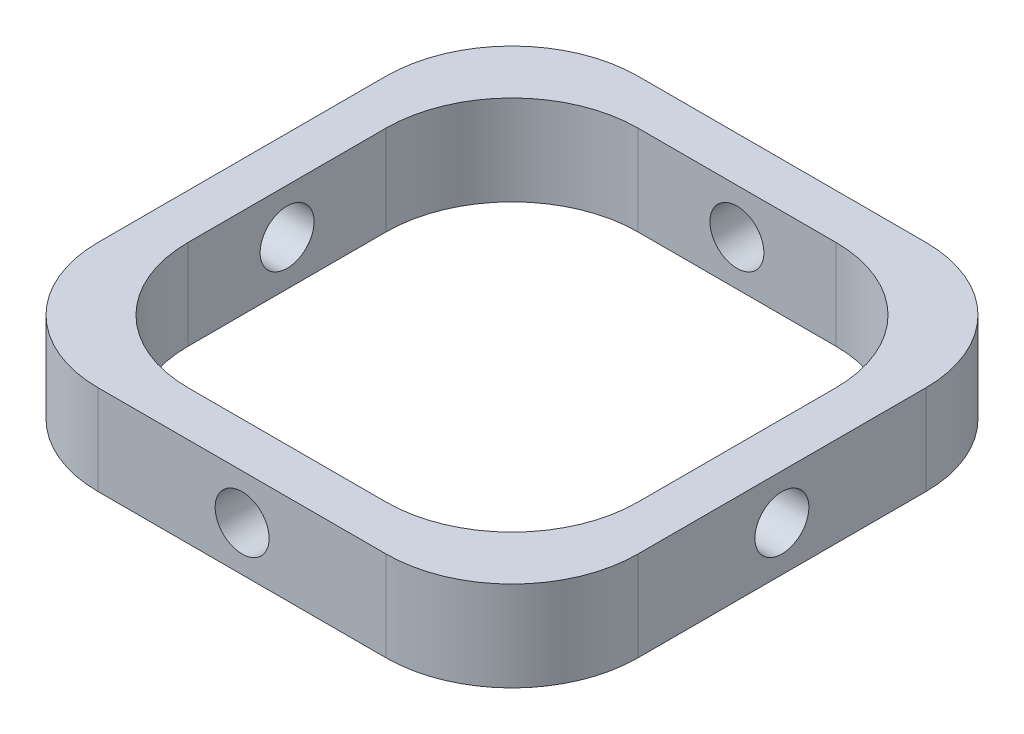
ISO-10303-21;
HEADER;
FILE_DESCRIPTION(('STEP AP214'),'2;1');
FILE_NAME('part.step','',(''),(''),'','','');
FILE_SCHEMA(('AUTOMOTIVE_DESIGN { 1 0 10303 214 1 1 1 1 }'));
ENDSEC;
DATA;
#1=APPLICATION_CONTEXT('core data for automotive mechanical design processes');
#2=APPLICATION_PROTOCOL_DEFINITION('international standard','automotive_design',2000,#1);
#3=PRODUCT_CONTEXT('',#1,'mechanical');
#4=PRODUCT('Part','Part','',(#3));
#5=PRODUCT_RELATED_PRODUCT_CATEGORY('part','',(#4));
#6=PRODUCT_DEFINITION_FORMATION('','',#4);
#7=PRODUCT_DEFINITION_CONTEXT('part definition',#1,'design');
#8=PRODUCT_DEFINITION('design','',#6,#7);
#9=PRODUCT_DEFINITION_SHAPE('','',#8);
#10=(LENGTH_UNIT() NAMED_UNIT(*) SI_UNIT(.MILLI.,.METRE.));
#11=(NAMED_UNIT(*) PLANE_ANGLE_UNIT() SI_UNIT($,.RADIAN.));
#12=(NAMED_UNIT(*) SI_UNIT($,.STERADIAN.) SOLID_ANGLE_UNIT());
#13=UNCERTAINTY_MEASURE_WITH_UNIT(LENGTH_MEASURE(1.E-05),#10,'distance_accuracy_value','');
#14=(GEOMETRIC_REPRESENTATION_CONTEXT(3) GLOBAL_UNCERTAINTY_ASSIGNED_CONTEXT((#13)) GLOBAL_UNIT_ASSIGNED_CONTEXT((#10,
#11,#12)) REPRESENTATION_CONTEXT('',''));
#15=CARTESIAN_POINT('',(0.,0.,0.));
#16=DIRECTION('',(0.,0.,1.));
#17=DIRECTION('',(1.,0.,0.));
#18=AXIS2_PLACEMENT_3D('',#15,#16,#17);
#19=CARTESIAN_POINT('',(0.,5.,0.));
#20=DIRECTION('',(0.,-1.,0.));
#21=DIRECTION('',(0.,0.,-1.));
#22=AXIS2_PLACEMENT_3D('',#19,#20,#21);
#23=PLANE('',#22);
#24=DIRECTION('',(0.,0.,1.));
#25=VECTOR('',#24,1.);
#26=CARTESIAN_POINT('',(-15.,5.,15.));
#27=LINE('',#26,#25);
#28=CARTESIAN_POINT('',(-15.,5.,-8.));
#29=VERTEX_POINT('',#28);
#30=CARTESIAN_POINT('',(-15.,5.,8.));
#31=VERTEX_POINT('',#30);
#32=EDGE_CURVE('E186',#29,#31,#27,.T.);
#33=ORIENTED_EDGE('',*,*,#32,.T.);
#34=CARTESIAN_POINT('',(-8.,5.,8.));
#35=DIRECTION('',(0.,-1.,0.));
#36=DIRECTION('',(0.,0.,-1.));
#37=AXIS2_PLACEMENT_3D('',#34,#35,#36);
#38=CIRCLE('',#37,7.);
#39=CARTESIAN_POINT('',(-8.,5.,15.));
#40=VERTEX_POINT('',#39);
#41=EDGE_CURVE('E228',#31,#40,#38,.F.);
#42=ORIENTED_EDGE('',*,*,#41,.T.);
#43=DIRECTION('',(1.,0.,0.));
#44=VECTOR('',#43,1.);
#45=CARTESIAN_POINT('',(-15.,5.,15.));
#46=LINE('',#45,#44);
#47=CARTESIAN_POINT('',(8.,5.,15.));
#48=VERTEX_POINT('',#47);
#49=EDGE_CURVE('E181',#40,#48,#46,.T.);
#50=ORIENTED_EDGE('',*,*,#49,.T.);
#51=CARTESIAN_POINT('',(8.,5.,8.));
#52=DIRECTION('',(0.,-1.,0.));
#53=DIRECTION('',(0.,0.,-1.));
#54=AXIS2_PLACEMENT_3D('',#51,#52,#53);
#55=CIRCLE('',#54,7.);
#56=CARTESIAN_POINT('',(15.,5.,8.));
#57=VERTEX_POINT('',#56);
#58=EDGE_CURVE('E226',#48,#57,#55,.F.);
#59=ORIENTED_EDGE('',*,*,#58,.T.);
#60=DIRECTION('',(0.,0.,-1.));
#61=VECTOR('',#60,1.);
#62=CARTESIAN_POINT('',(15.,5.,15.));
#63=LINE('',#62,#61);
#64=CARTESIAN_POINT('',(15.,5.,-8.));
#65=VERTEX_POINT('',#64);
#66=EDGE_CURVE('E277',#57,#65,#63,.T.);
#67=ORIENTED_EDGE('',*,*,#66,.T.);
#68=CARTESIAN_POINT('',(8.,5.,-8.));
#69=DIRECTION('',(0.,-1.,0.));
#70=DIRECTION('',(0.,0.,-1.));
#71=AXIS2_PLACEMENT_3D('',#68,#69,#70);
#72=CIRCLE('',#71,7.);
#73=CARTESIAN_POINT('',(8.,5.,-15.));
#74=VERTEX_POINT('',#73);
#75=EDGE_CURVE('E65',#65,#74,#72,.F.);
#76=ORIENTED_EDGE('',*,*,#75,.T.);
#77=DIRECTION('',(-1.,0.,0.));
#78=VECTOR('',#77,1.);
#79=CARTESIAN_POINT('',(-15.,5.,-15.));
#80=LINE('',#79,#78);
#81=CARTESIAN_POINT('',(-8.,5.,-15.));
#82=VERTEX_POINT('',#81);
#83=EDGE_CURVE('E279',#74,#82,#80,.T.);
#84=ORIENTED_EDGE('',*,*,#83,.T.);
#85=CARTESIAN_POINT('',(-8.,5.,-8.));
#86=DIRECTION('',(0.,-1.,0.));
#87=DIRECTION('',(0.,0.,-1.));
#88=AXIS2_PLACEMENT_3D('',#85,#86,#87);
#89=CIRCLE('',#88,7.);
#90=EDGE_CURVE('E223',#82,#29,#89,.F.);
#91=ORIENTED_EDGE('',*,*,#90,.T.);
#92=EDGE_LOOP('',(#33,#42,#50,#59,#67,#76,#84,#91));
#93=FACE_BOUND('',#92,.T.);
#94=DIRECTION('',(0.,0.,1.));
#95=VECTOR('',#94,1.);
#96=CARTESIAN_POINT('',(-12.5,5.,12.5));
#97=LINE('',#96,#95);
#98=CARTESIAN_POINT('',(-12.5,5.,-5.49999999999999));
#99=VERTEX_POINT('',#98);
#100=CARTESIAN_POINT('',(-12.5,5.,5.5));
#101=VERTEX_POINT('',#100);
#102=EDGE_CURVE('E271',#99,#101,#97,.T.);
#103=ORIENTED_EDGE('',*,*,#102,.F.);
#104=CARTESIAN_POINT('',(-5.5,5.,-5.5));
#105=DIRECTION('',(0.,-1.,0.));
#106=DIRECTION('',(0.,0.,-1.));
#107=AXIS2_PLACEMENT_3D('',#104,#105,#106);
#108=CIRCLE('',#107,7.);
#109=CARTESIAN_POINT('',(-5.5,5.,-12.5));
#110=VERTEX_POINT('',#109);
#111=EDGE_CURVE('E11',#99,#110,#108,.T.);
#112=ORIENTED_EDGE('',*,*,#111,.T.);
#113=DIRECTION('',(-1.,0.,0.));
#114=VECTOR('',#113,1.);
#115=CARTESIAN_POINT('',(-12.5,5.,-12.5));
#116=LINE('',#115,#114);
#117=CARTESIAN_POINT('',(5.49999999999999,5.,-12.5));
#118=VERTEX_POINT('',#117);
#119=EDGE_CURVE('E257',#118,#110,#116,.T.);
#120=ORIENTED_EDGE('',*,*,#119,.F.);
#121=CARTESIAN_POINT('',(5.5,5.,-5.5));
#122=DIRECTION('',(0.,-1.,0.));
#123=DIRECTION('',(0.,0.,-1.));
#124=AXIS2_PLACEMENT_3D('',#121,#122,#123);
#125=CIRCLE('',#124,7.);
#126=CARTESIAN_POINT('',(12.5,5.,-5.49999999999999));
#127=VERTEX_POINT('',#126);
#128=EDGE_CURVE('E167',#118,#127,#125,.T.);
#129=ORIENTED_EDGE('',*,*,#128,.T.);
#130=DIRECTION('',(0.,0.,-1.));
#131=VECTOR('',#130,1.);
#132=CARTESIAN_POINT('',(12.5,5.,12.5));
#133=LINE('',#132,#131);
#134=CARTESIAN_POINT('',(12.5,5.,5.5));
#135=VERTEX_POINT('',#134);
#136=EDGE_CURVE('E254',#135,#127,#133,.T.);
#137=ORIENTED_EDGE('',*,*,#136,.F.);
#138=CARTESIAN_POINT('',(5.5,5.,5.5));
#139=DIRECTION('',(0.,-1.,0.));
#140=DIRECTION('',(0.,0.,-1.));
#141=AXIS2_PLACEMENT_3D('',#138,#139,#140);
#142=CIRCLE('',#141,7.);
#143=CARTESIAN_POINT('',(5.5,5.,12.5));
#144=VERTEX_POINT('',#143);
#145=EDGE_CURVE('E245',#135,#144,#142,.T.);
#146=ORIENTED_EDGE('',*,*,#145,.T.);
#147=DIRECTION('',(1.,0.,0.));
#148=VECTOR('',#147,1.);
#149=CARTESIAN_POINT('',(-12.5,5.,12.5));
#150=LINE('',#149,#148);
#151=CARTESIAN_POINT('',(-5.5,5.,12.5));
#152=VERTEX_POINT('',#151);
#153=EDGE_CURVE('E265',#152,#144,#150,.T.);
#154=ORIENTED_EDGE('',*,*,#153,.F.);
#155=CARTESIAN_POINT('',(-5.5,5.,5.5));
#156=DIRECTION('',(0.,-1.,0.));
#157=DIRECTION('',(0.,0.,-1.));
#158=AXIS2_PLACEMENT_3D('',#155,#156,#157);
#159=CIRCLE('',#158,7.);
#160=EDGE_CURVE('E241',#152,#101,#159,.T.);
#161=ORIENTED_EDGE('',*,*,#160,.T.);
#162=EDGE_LOOP('',(#103,#112,#120,#129,#137,#146,#154,#161));
#163=FACE_BOUND('',#162,.T.);
#164=ADVANCED_FACE('F43',(#93,#163),#23,.F.);
#165=CARTESIAN_POINT('',(0.,0.,0.));
#166=DIRECTION('',(0.,-1.,0.));
#167=DIRECTION('',(0.,0.,-1.));
#168=AXIS2_PLACEMENT_3D('',#165,#166,#167);
#169=PLANE('',#168);
#170=DIRECTION('',(1.,0.,0.));
#171=VECTOR('',#170,1.);
#172=CARTESIAN_POINT('',(-15.,0.,15.));
#173=LINE('',#172,#171);
#174=CARTESIAN_POINT('',(-8.,0.,15.));
#175=VERTEX_POINT('',#174);
#176=CARTESIAN_POINT('',(8.,0.,15.));
#177=VERTEX_POINT('',#176);
#178=EDGE_CURVE('E280',#175,#177,#173,.T.);
#179=ORIENTED_EDGE('',*,*,#178,.F.);
#180=CARTESIAN_POINT('',(-8.,0.,8.));
#181=DIRECTION('',(0.,-1.,0.));
#182=DIRECTION('',(0.,0.,-1.));
#183=AXIS2_PLACEMENT_3D('',#180,#181,#182);
#184=CIRCLE('',#183,7.);
#185=CARTESIAN_POINT('',(-15.,0.,8.));
#186=VERTEX_POINT('',#185);
#187=EDGE_CURVE('E216',#175,#186,#184,.T.);
#188=ORIENTED_EDGE('',*,*,#187,.T.);
#189=DIRECTION('',(0.,0.,1.));
#190=VECTOR('',#189,1.);
#191=CARTESIAN_POINT('',(-15.,0.,15.));
#192=LINE('',#191,#190);
#193=CARTESIAN_POINT('',(-15.,0.,-8.));
#194=VERTEX_POINT('',#193);
#195=EDGE_CURVE('E289',#194,#186,#192,.T.);
#196=ORIENTED_EDGE('',*,*,#195,.F.);
#197=CARTESIAN_POINT('',(-8.,0.,-8.));
#198=DIRECTION('',(0.,-1.,0.));
#199=DIRECTION('',(0.,0.,-1.));
#200=AXIS2_PLACEMENT_3D('',#197,#198,#199);
#201=CIRCLE('',#200,7.);
#202=CARTESIAN_POINT('',(-8.,0.,-15.));
#203=VERTEX_POINT('',#202);
#204=EDGE_CURVE('E210',#194,#203,#201,.T.);
#205=ORIENTED_EDGE('',*,*,#204,.T.);
#206=DIRECTION('',(-1.,0.,0.));
#207=VECTOR('',#206,1.);
#208=CARTESIAN_POINT('',(-15.,0.,-15.));
#209=LINE('',#208,#207);
#210=CARTESIAN_POINT('',(8.,0.,-15.));
#211=VERTEX_POINT('',#210);
#212=EDGE_CURVE('E287',#211,#203,#209,.T.);
#213=ORIENTED_EDGE('',*,*,#212,.F.);
#214=CARTESIAN_POINT('',(8.,0.,-8.));
#215=DIRECTION('',(0.,-1.,0.));
#216=DIRECTION('',(0.,0.,-1.));
#217=AXIS2_PLACEMENT_3D('',#214,#215,#216);
#218=CIRCLE('',#217,7.);
#219=CARTESIAN_POINT('',(15.,0.,-8.));
#220=VERTEX_POINT('',#219);
#221=EDGE_CURVE('E212',#211,#220,#218,.T.);
#222=ORIENTED_EDGE('',*,*,#221,.T.);
#223=DIRECTION('',(0.,0.,-1.));
#224=VECTOR('',#223,1.);
#225=CARTESIAN_POINT('',(15.,0.,15.));
#226=LINE('',#225,#224);
#227=CARTESIAN_POINT('',(15.,0.,8.));
#228=VERTEX_POINT('',#227);
#229=EDGE_CURVE('E284',#228,#220,#226,.T.);
#230=ORIENTED_EDGE('',*,*,#229,.F.);
#231=CARTESIAN_POINT('',(8.,0.,8.));
#232=DIRECTION('',(0.,-1.,0.));
#233=DIRECTION('',(0.,0.,-1.));
#234=AXIS2_PLACEMENT_3D('',#231,#232,#233);
#235=CIRCLE('',#234,7.);
#236=EDGE_CURVE('E214',#228,#177,#235,.T.);
#237=ORIENTED_EDGE('',*,*,#236,.T.);
#238=EDGE_LOOP('',(#179,#188,#196,#205,#213,#222,#230,#237));
#239=FACE_BOUND('',#238,.T.);
#240=DIRECTION('',(0.,0.,-1.));
#241=VECTOR('',#240,1.);
#242=CARTESIAN_POINT('',(12.5,0.,12.5));
#243=LINE('',#242,#241);
#244=CARTESIAN_POINT('',(12.5,0.,5.5));
#245=VERTEX_POINT('',#244);
#246=CARTESIAN_POINT('',(12.5,0.,-5.49999999999999));
#247=VERTEX_POINT('',#246);
#248=EDGE_CURVE('E268',#245,#247,#243,.T.);
#249=ORIENTED_EDGE('',*,*,#248,.T.);
#250=CARTESIAN_POINT('',(5.5,0.,-5.5));
#251=DIRECTION('',(0.,-1.,0.));
#252=DIRECTION('',(0.,0.,-1.));
#253=AXIS2_PLACEMENT_3D('',#250,#251,#252);
#254=CIRCLE('',#253,7.);
#255=CARTESIAN_POINT('',(5.49999999999999,0.,-12.5));
#256=VERTEX_POINT('',#255);
#257=EDGE_CURVE('E247',#247,#256,#254,.F.);
#258=ORIENTED_EDGE('',*,*,#257,.T.);
#259=DIRECTION('',(-1.,0.,0.));
#260=VECTOR('',#259,1.);
#261=CARTESIAN_POINT('',(-12.5,0.,-12.5));
#262=LINE('',#261,#260);
#263=CARTESIAN_POINT('',(-5.5,0.,-12.5));
#264=VERTEX_POINT('',#263);
#265=EDGE_CURVE('E162',#256,#264,#262,.T.);
#266=ORIENTED_EDGE('',*,*,#265,.T.);
#267=CARTESIAN_POINT('',(-5.5,0.,-5.5));
#268=DIRECTION('',(0.,-1.,0.));
#269=DIRECTION('',(0.,0.,-1.));
#270=AXIS2_PLACEMENT_3D('',#267,#268,#269);
#271=CIRCLE('',#270,7.);
#272=CARTESIAN_POINT('',(-12.5,0.,-5.49999999999999));
#273=VERTEX_POINT('',#272);
#274=EDGE_CURVE('E51',#264,#273,#271,.F.);
#275=ORIENTED_EDGE('',*,*,#274,.T.);
#276=DIRECTION('',(0.,0.,1.));
#277=VECTOR('',#276,1.);
#278=CARTESIAN_POINT('',(-12.5,0.,12.5));
#279=LINE('',#278,#277);
#280=CARTESIAN_POINT('',(-12.5,0.,5.5));
#281=VERTEX_POINT('',#280);
#282=EDGE_CURVE('E160',#273,#281,#279,.T.);
#283=ORIENTED_EDGE('',*,*,#282,.T.);
#284=CARTESIAN_POINT('',(-5.5,0.,5.5));
#285=DIRECTION('',(0.,-1.,0.));
#286=DIRECTION('',(0.,0.,-1.));
#287=AXIS2_PLACEMENT_3D('',#284,#285,#286);
#288=CIRCLE('',#287,7.);
#289=CARTESIAN_POINT('',(-5.5,0.,12.5));
#290=VERTEX_POINT('',#289);
#291=EDGE_CURVE('E239',#281,#290,#288,.F.);
#292=ORIENTED_EDGE('',*,*,#291,.T.);
#293=DIRECTION('',(1.,0.,0.));
#294=VECTOR('',#293,1.);
#295=CARTESIAN_POINT('',(-12.5,0.,12.5));
#296=LINE('',#295,#294);
#297=CARTESIAN_POINT('',(5.5,0.,12.5));
#298=VERTEX_POINT('',#297);
#299=EDGE_CURVE('E176',#290,#298,#296,.T.);
#300=ORIENTED_EDGE('',*,*,#299,.T.);
#301=CARTESIAN_POINT('',(5.5,0.,5.5));
#302=DIRECTION('',(0.,-1.,0.));
#303=DIRECTION('',(0.,0.,-1.));
#304=AXIS2_PLACEMENT_3D('',#301,#302,#303);
#305=CIRCLE('',#304,7.);
#306=EDGE_CURVE('E243',#298,#245,#305,.F.);
#307=ORIENTED_EDGE('',*,*,#306,.T.);
#308=EDGE_LOOP('',(#249,#258,#266,#275,#283,#292,#300,#307));
#309=FACE_BOUND('',#308,.T.);
#310=ADVANCED_FACE('F159',(#239,#309),#169,.T.);
#311=CARTESIAN_POINT('',(15.,5.,15.));
#312=DIRECTION('',(-1.,0.,0.));
#313=DIRECTION('',(0.,0.,1.));
#314=AXIS2_PLACEMENT_3D('',#311,#312,#313);
#315=PLANE('',#314);
#316=CARTESIAN_POINT('',(15.,2.5,0.));
#317=DIRECTION('',(-1.,0.,0.));
#318=DIRECTION('',(0.,0.,1.));
#319=AXIS2_PLACEMENT_3D('',#316,#317,#318);
#320=CIRCLE('',#319,1.5);
#321=CARTESIAN_POINT('',(15.,2.5,1.5));
#322=VERTEX_POINT('',#321);
#323=EDGE_CURVE('E366',#322,#322,#320,.T.);
#324=ORIENTED_EDGE('',*,*,#323,.T.);
#325=EDGE_LOOP('',(#324));
#326=FACE_BOUND('',#325,.T.);
#327=ORIENTED_EDGE('',*,*,#66,.F.);
#328=DIRECTION('',(0.,-1.,0.));
#329=VECTOR('',#328,1.);
#330=CARTESIAN_POINT('',(15.,5.,8.));
#331=LINE('',#330,#329);
#332=EDGE_CURVE('E232',#57,#228,#331,.T.);
#333=ORIENTED_EDGE('',*,*,#332,.T.);
#334=ORIENTED_EDGE('',*,*,#229,.T.);
#335=DIRECTION('',(0.,-1.,0.));
#336=VECTOR('',#335,1.);
#337=CARTESIAN_POINT('',(15.,5.,-8.));
#338=LINE('',#337,#336);
#339=EDGE_CURVE('E230',#220,#65,#338,.F.);
#340=ORIENTED_EDGE('',*,*,#339,.T.);
#341=EDGE_LOOP('',(#327,#333,#334,#340));
#342=FACE_BOUND('',#341,.T.);
#343=ADVANCED_FACE('F342',(#326,#342),#315,.F.);
#344=CARTESIAN_POINT('',(-15.,5.,-15.));
#345=DIRECTION('',(0.,0.,1.));
#346=DIRECTION('',(1.,0.,0.));
#347=AXIS2_PLACEMENT_3D('',#344,#345,#346);
#348=PLANE('',#347);
#349=CARTESIAN_POINT('',(0.,2.5,-15.));
#350=DIRECTION('',(0.,0.,1.));
#351=DIRECTION('',(1.,0.,0.));
#352=AXIS2_PLACEMENT_3D('',#349,#350,#351);
#353=CIRCLE('',#352,1.5);
#354=CARTESIAN_POINT('',(1.49999999999999,2.5,-15.));
#355=VERTEX_POINT('',#354);
#356=EDGE_CURVE('E296',#355,#355,#353,.T.);
#357=ORIENTED_EDGE('',*,*,#356,.T.);
#358=EDGE_LOOP('',(#357));
#359=FACE_BOUND('',#358,.T.);
#360=ORIENTED_EDGE('',*,*,#83,.F.);
#361=DIRECTION('',(0.,-1.,0.));
#362=VECTOR('',#361,1.);
#363=CARTESIAN_POINT('',(8.,5.,-15.));
#364=LINE('',#363,#362);
#365=EDGE_CURVE('E236',#74,#211,#364,.T.);
#366=ORIENTED_EDGE('',*,*,#365,.T.);
#367=ORIENTED_EDGE('',*,*,#212,.T.);
#368=DIRECTION('',(0.,-1.,0.));
#369=VECTOR('',#368,1.);
#370=CARTESIAN_POINT('',(-8.,5.,-15.));
#371=LINE('',#370,#369);
#372=EDGE_CURVE('E58',#203,#82,#371,.F.);
#373=ORIENTED_EDGE('',*,*,#372,.T.);
#374=EDGE_LOOP('',(#360,#366,#367,#373));
#375=FACE_BOUND('',#374,.T.);
#376=ADVANCED_FACE('F355',(#359,#375),#348,.F.);
#377=CARTESIAN_POINT('',(-15.,5.,15.));
#378=DIRECTION('',(1.,0.,0.));
#379=DIRECTION('',(0.,0.,-1.));
#380=AXIS2_PLACEMENT_3D('',#377,#378,#379);
#381=PLANE('',#380);
#382=CARTESIAN_POINT('',(-15.,2.5,0.));
#383=DIRECTION('',(1.,0.,0.));
#384=DIRECTION('',(0.,0.,-1.));
#385=AXIS2_PLACEMENT_3D('',#382,#383,#384);
#386=CIRCLE('',#385,1.5);
#387=CARTESIAN_POINT('',(-15.,2.5,-1.5));
#388=VERTEX_POINT('',#387);
#389=EDGE_CURVE('E302',#388,#388,#386,.T.);
#390=ORIENTED_EDGE('',*,*,#389,.T.);
#391=EDGE_LOOP('',(#390));
#392=FACE_BOUND('',#391,.T.);
#393=ORIENTED_EDGE('',*,*,#195,.T.);
#394=DIRECTION('',(0.,-1.,0.));
#395=VECTOR('',#394,1.);
#396=CARTESIAN_POINT('',(-15.,5.,8.));
#397=LINE('',#396,#395);
#398=EDGE_CURVE('E221',#186,#31,#397,.F.);
#399=ORIENTED_EDGE('',*,*,#398,.T.);
#400=ORIENTED_EDGE('',*,*,#32,.F.);
#401=DIRECTION('',(0.,-1.,0.));
#402=VECTOR('',#401,1.);
#403=CARTESIAN_POINT('',(-15.,5.,-8.));
#404=LINE('',#403,#402);
#405=EDGE_CURVE('E218',#29,#194,#404,.T.);
#406=ORIENTED_EDGE('',*,*,#405,.T.);
#407=EDGE_LOOP('',(#393,#399,#400,#406));
#408=FACE_BOUND('',#407,.T.);
#409=ADVANCED_FACE('F351',(#392,#408),#381,.F.);
#410=CARTESIAN_POINT('',(-15.,5.,15.));
#411=DIRECTION('',(0.,0.,-1.));
#412=DIRECTION('',(-1.,0.,0.));
#413=AXIS2_PLACEMENT_3D('',#410,#411,#412);
#414=PLANE('',#413);
#415=CARTESIAN_POINT('',(0.,2.5,15.));
#416=DIRECTION('',(0.,0.,-1.));
#417=DIRECTION('',(-1.,0.,0.));
#418=AXIS2_PLACEMENT_3D('',#415,#416,#417);
#419=CIRCLE('',#418,1.5);
#420=CARTESIAN_POINT('',(-1.50000000000001,2.5,15.));
#421=VERTEX_POINT('',#420);
#422=EDGE_CURVE('E177',#421,#421,#419,.T.);
#423=ORIENTED_EDGE('',*,*,#422,.T.);
#424=EDGE_LOOP('',(#423));
#425=FACE_BOUND('',#424,.T.);
#426=ORIENTED_EDGE('',*,*,#49,.F.);
#427=DIRECTION('',(0.,-1.,0.));
#428=VECTOR('',#427,1.);
#429=CARTESIAN_POINT('',(-8.,5.,15.));
#430=LINE('',#429,#428);
#431=EDGE_CURVE('E207',#40,#175,#430,.T.);
#432=ORIENTED_EDGE('',*,*,#431,.T.);
#433=ORIENTED_EDGE('',*,*,#178,.T.);
#434=DIRECTION('',(0.,-1.,0.));
#435=VECTOR('',#434,1.);
#436=CARTESIAN_POINT('',(8.,5.,15.));
#437=LINE('',#436,#435);
#438=EDGE_CURVE('E205',#177,#48,#437,.F.);
#439=ORIENTED_EDGE('',*,*,#438,.T.);
#440=EDGE_LOOP('',(#426,#432,#433,#439));
#441=FACE_BOUND('',#440,.T.);
#442=ADVANCED_FACE('F348',(#425,#441),#414,.F.);
#443=CARTESIAN_POINT('',(-12.5,5.,12.5));
#444=DIRECTION('',(1.,0.,0.));
#445=DIRECTION('',(0.,0.,-1.));
#446=AXIS2_PLACEMENT_3D('',#443,#444,#445);
#447=PLANE('',#446);
#448=CARTESIAN_POINT('',(-12.5,2.5,0.));
#449=DIRECTION('',(1.,0.,0.));
#450=DIRECTION('',(0.,0.,-1.));
#451=AXIS2_PLACEMENT_3D('',#448,#449,#450);
#452=CIRCLE('',#451,1.5);
#453=CARTESIAN_POINT('',(-12.5,2.5,-1.5));
#454=VERTEX_POINT('',#453);
#455=EDGE_CURVE('E307',#454,#454,#452,.T.);
#456=ORIENTED_EDGE('',*,*,#455,.F.);
#457=EDGE_LOOP('',(#456));
#458=FACE_BOUND('',#457,.T.);
#459=ORIENTED_EDGE('',*,*,#102,.T.);
#460=DIRECTION('',(0.,-1.,0.));
#461=VECTOR('',#460,1.);
#462=CARTESIAN_POINT('',(-12.5,0.,5.5));
#463=LINE('',#462,#461);
#464=EDGE_CURVE('E175',#101,#281,#463,.T.);
#465=ORIENTED_EDGE('',*,*,#464,.T.);
#466=ORIENTED_EDGE('',*,*,#282,.F.);
#467=DIRECTION('',(0.,-1.,0.));
#468=VECTOR('',#467,1.);
#469=CARTESIAN_POINT('',(-12.5,5.,-5.5));
#470=LINE('',#469,#468);
#471=EDGE_CURVE('E172',#273,#99,#470,.F.);
#472=ORIENTED_EDGE('',*,*,#471,.T.);
#473=EDGE_LOOP('',(#459,#465,#466,#472));
#474=FACE_BOUND('',#473,.T.);
#475=ADVANCED_FACE('F171',(#458,#474),#447,.T.);
#476=CARTESIAN_POINT('',(-12.5,5.,12.5));
#477=DIRECTION('',(0.,0.,-1.));
#478=DIRECTION('',(-1.,0.,0.));
#479=AXIS2_PLACEMENT_3D('',#476,#477,#478);
#480=PLANE('',#479);
#481=CARTESIAN_POINT('',(0.,2.5,12.5));
#482=DIRECTION('',(0.,0.,-1.));
#483=DIRECTION('',(-1.,0.,0.));
#484=AXIS2_PLACEMENT_3D('',#481,#482,#483);
#485=CIRCLE('',#484,1.5);
#486=CARTESIAN_POINT('',(-1.50000000000001,2.5,12.5));
#487=VERTEX_POINT('',#486);
#488=EDGE_CURVE('E295',#487,#487,#485,.T.);
#489=ORIENTED_EDGE('',*,*,#488,.F.);
#490=EDGE_LOOP('',(#489));
#491=FACE_BOUND('',#490,.T.);
#492=ORIENTED_EDGE('',*,*,#299,.F.);
#493=DIRECTION('',(0.,-1.,0.));
#494=VECTOR('',#493,1.);
#495=CARTESIAN_POINT('',(-5.5,5.,12.5));
#496=LINE('',#495,#494);
#497=EDGE_CURVE('E194',#290,#152,#496,.F.);
#498=ORIENTED_EDGE('',*,*,#497,.T.);
#499=ORIENTED_EDGE('',*,*,#153,.T.);
#500=DIRECTION('',(0.,-1.,0.));
#501=VECTOR('',#500,1.);
#502=CARTESIAN_POINT('',(5.5,0.,12.5));
#503=LINE('',#502,#501);
#504=EDGE_CURVE('E183',#144,#298,#503,.T.);
#505=ORIENTED_EDGE('',*,*,#504,.T.);
#506=EDGE_LOOP('',(#492,#498,#499,#505));
#507=FACE_BOUND('',#506,.T.);
#508=ADVANCED_FACE('F319',(#491,#507),#480,.T.);
#509=CARTESIAN_POINT('',(12.5,5.,12.5));
#510=DIRECTION('',(-1.,0.,0.));
#511=DIRECTION('',(0.,0.,1.));
#512=AXIS2_PLACEMENT_3D('',#509,#510,#511);
#513=PLANE('',#512);
#514=CARTESIAN_POINT('',(12.5,2.5,0.));
#515=DIRECTION('',(-1.,0.,0.));
#516=DIRECTION('',(0.,0.,1.));
#517=AXIS2_PLACEMENT_3D('',#514,#515,#516);
#518=CIRCLE('',#517,1.5);
#519=CARTESIAN_POINT('',(12.5,2.5,1.5));
#520=VERTEX_POINT('',#519);
#521=EDGE_CURVE('E189',#520,#520,#518,.T.);
#522=ORIENTED_EDGE('',*,*,#521,.F.);
#523=EDGE_LOOP('',(#522));
#524=FACE_BOUND('',#523,.T.);
#525=ORIENTED_EDGE('',*,*,#248,.F.);
#526=DIRECTION('',(0.,-1.,0.));
#527=VECTOR('',#526,1.);
#528=CARTESIAN_POINT('',(12.5,5.,5.5));
#529=LINE('',#528,#527);
#530=EDGE_CURVE('E199',#245,#135,#529,.F.);
#531=ORIENTED_EDGE('',*,*,#530,.T.);
#532=ORIENTED_EDGE('',*,*,#136,.T.);
#533=DIRECTION('',(0.,-1.,0.));
#534=VECTOR('',#533,1.);
#535=CARTESIAN_POINT('',(12.5,0.,-5.5));
#536=LINE('',#535,#534);
#537=EDGE_CURVE('E196',#127,#247,#536,.T.);
#538=ORIENTED_EDGE('',*,*,#537,.T.);
#539=EDGE_LOOP('',(#525,#531,#532,#538));
#540=FACE_BOUND('',#539,.T.);
#541=ADVANCED_FACE('F263',(#524,#540),#513,.T.);
#542=CARTESIAN_POINT('',(-12.5,5.,-12.5));
#543=DIRECTION('',(0.,0.,1.));
#544=DIRECTION('',(1.,0.,0.));
#545=AXIS2_PLACEMENT_3D('',#542,#543,#544);
#546=PLANE('',#545);
#547=CARTESIAN_POINT('',(0.,2.5,-12.5));
#548=DIRECTION('',(0.,0.,1.));
#549=DIRECTION('',(1.,0.,0.));
#550=AXIS2_PLACEMENT_3D('',#547,#548,#549);
#551=CIRCLE('',#550,1.5);
#552=CARTESIAN_POINT('',(1.49999999999999,2.5,-12.5));
#553=VERTEX_POINT('',#552);
#554=EDGE_CURVE('E293',#553,#553,#551,.T.);
#555=ORIENTED_EDGE('',*,*,#554,.F.);
#556=EDGE_LOOP('',(#555));
#557=FACE_BOUND('',#556,.T.);
#558=ORIENTED_EDGE('',*,*,#265,.F.);
#559=DIRECTION('',(0.,-1.,0.));
#560=VECTOR('',#559,1.);
#561=CARTESIAN_POINT('',(5.5,5.,-12.5));
#562=LINE('',#561,#560);
#563=EDGE_CURVE('E203',#256,#118,#562,.F.);
#564=ORIENTED_EDGE('',*,*,#563,.T.);
#565=ORIENTED_EDGE('',*,*,#119,.T.);
#566=DIRECTION('',(0.,-1.,0.));
#567=VECTOR('',#566,1.);
#568=CARTESIAN_POINT('',(-5.5,0.,-12.5));
#569=LINE('',#568,#567);
#570=EDGE_CURVE('E201',#110,#264,#569,.T.);
#571=ORIENTED_EDGE('',*,*,#570,.T.);
#572=EDGE_LOOP('',(#558,#564,#565,#571));
#573=FACE_BOUND('',#572,.T.);
#574=ADVANCED_FACE('F270',(#557,#573),#546,.T.);
#575=CARTESIAN_POINT('',(0.,2.5,-15.));
#576=DIRECTION('',(0.,0.,1.));
#577=DIRECTION('',(1.,0.,0.));
#578=AXIS2_PLACEMENT_3D('',#575,#576,#577);
#579=CYLINDRICAL_SURFACE('',#578,1.5);
#580=ORIENTED_EDGE('',*,*,#554,.T.);
#581=EDGE_LOOP('',(#580));
#582=FACE_BOUND('',#581,.T.);
#583=ORIENTED_EDGE('',*,*,#356,.F.);
#584=EDGE_LOOP('',(#583));
#585=FACE_BOUND('',#584,.T.);
#586=ADVANCED_FACE('F467',(#582,#585),#579,.F.);
#587=ORIENTED_EDGE('',*,*,#488,.T.);
#588=EDGE_LOOP('',(#587));
#589=FACE_BOUND('',#588,.T.);
#590=ORIENTED_EDGE('',*,*,#422,.F.);
#591=EDGE_LOOP('',(#590));
#592=FACE_BOUND('',#591,.T.);
#593=ADVANCED_FACE('F459',(#589,#592),#579,.F.);
#594=CARTESIAN_POINT('',(15.,2.5,0.));
#595=DIRECTION('',(-1.,0.,0.));
#596=DIRECTION('',(0.,0.,1.));
#597=AXIS2_PLACEMENT_3D('',#594,#595,#596);
#598=CYLINDRICAL_SURFACE('',#597,1.5);
#599=ORIENTED_EDGE('',*,*,#521,.T.);
#600=EDGE_LOOP('',(#599));
#601=FACE_BOUND('',#600,.T.);
#602=ORIENTED_EDGE('',*,*,#323,.F.);
#603=EDGE_LOOP('',(#602));
#604=FACE_BOUND('',#603,.T.);
#605=ADVANCED_FACE('F450',(#601,#604),#598,.F.);
#606=ORIENTED_EDGE('',*,*,#455,.T.);
#607=EDGE_LOOP('',(#606));
#608=FACE_BOUND('',#607,.T.);
#609=ORIENTED_EDGE('',*,*,#389,.F.);
#610=EDGE_LOOP('',(#609));
#611=FACE_BOUND('',#610,.T.);
#612=ADVANCED_FACE('F334',(#608,#611),#598,.F.);
#613=CARTESIAN_POINT('',(-5.5,5.,5.5));
#614=DIRECTION('',(0.,1.,0.));
#615=DIRECTION('',(0.,0.,1.));
#616=AXIS2_PLACEMENT_3D('',#613,#614,#615);
#617=CYLINDRICAL_SURFACE('',#616,7.);
#618=ORIENTED_EDGE('',*,*,#160,.F.);
#619=ORIENTED_EDGE('',*,*,#497,.F.);
#620=ORIENTED_EDGE('',*,*,#291,.F.);
#621=ORIENTED_EDGE('',*,*,#464,.F.);
#622=EDGE_LOOP('',(#618,#619,#620,#621));
#623=FACE_BOUND('',#622,.T.);
#624=ADVANCED_FACE('F324',(#623),#617,.F.);
#625=CARTESIAN_POINT('',(5.5,5.,5.5));
#626=DIRECTION('',(0.,1.,0.));
#627=DIRECTION('',(0.,0.,1.));
#628=AXIS2_PLACEMENT_3D('',#625,#626,#627);
#629=CYLINDRICAL_SURFACE('',#628,7.);
#630=ORIENTED_EDGE('',*,*,#145,.F.);
#631=ORIENTED_EDGE('',*,*,#530,.F.);
#632=ORIENTED_EDGE('',*,*,#306,.F.);
#633=ORIENTED_EDGE('',*,*,#504,.F.);
#634=EDGE_LOOP('',(#630,#631,#632,#633));
#635=FACE_BOUND('',#634,.T.);
#636=ADVANCED_FACE('F326',(#635),#629,.F.);
#637=CARTESIAN_POINT('',(5.5,5.,-5.5));
#638=DIRECTION('',(0.,1.,0.));
#639=DIRECTION('',(0.,0.,1.));
#640=AXIS2_PLACEMENT_3D('',#637,#638,#639);
#641=CYLINDRICAL_SURFACE('',#640,7.);
#642=ORIENTED_EDGE('',*,*,#128,.F.);
#643=ORIENTED_EDGE('',*,*,#563,.F.);
#644=ORIENTED_EDGE('',*,*,#257,.F.);
#645=ORIENTED_EDGE('',*,*,#537,.F.);
#646=EDGE_LOOP('',(#642,#643,#644,#645));
#647=FACE_BOUND('',#646,.T.);
#648=ADVANCED_FACE('F267',(#647),#641,.F.);
#649=CARTESIAN_POINT('',(-5.5,5.,-5.5));
#650=DIRECTION('',(0.,1.,0.));
#651=DIRECTION('',(0.,0.,1.));
#652=AXIS2_PLACEMENT_3D('',#649,#650,#651);
#653=CYLINDRICAL_SURFACE('',#652,7.);
#654=ORIENTED_EDGE('',*,*,#111,.F.);
#655=ORIENTED_EDGE('',*,*,#471,.F.);
#656=ORIENTED_EDGE('',*,*,#274,.F.);
#657=ORIENTED_EDGE('',*,*,#570,.F.);
#658=EDGE_LOOP('',(#654,#655,#656,#657));
#659=FACE_BOUND('',#658,.T.);
#660=ADVANCED_FACE('F180',(#659),#653,.F.);
#661=CARTESIAN_POINT('',(-8.,5.,8.));
#662=DIRECTION('',(0.,-1.,0.));
#663=DIRECTION('',(0.,0.,-1.));
#664=AXIS2_PLACEMENT_3D('',#661,#662,#663);
#665=CYLINDRICAL_SURFACE('',#664,7.);
#666=ORIENTED_EDGE('',*,*,#41,.F.);
#667=ORIENTED_EDGE('',*,*,#398,.F.);
#668=ORIENTED_EDGE('',*,*,#187,.F.);
#669=ORIENTED_EDGE('',*,*,#431,.F.);
#670=EDGE_LOOP('',(#666,#667,#668,#669));
#671=FACE_BOUND('',#670,.T.);
#672=ADVANCED_FACE('F381',(#671),#665,.T.);
#673=CARTESIAN_POINT('',(8.,5.,8.));
#674=DIRECTION('',(0.,-1.,0.));
#675=DIRECTION('',(0.,0.,-1.));
#676=AXIS2_PLACEMENT_3D('',#673,#674,#675);
#677=CYLINDRICAL_SURFACE('',#676,7.);
#678=ORIENTED_EDGE('',*,*,#58,.F.);
#679=ORIENTED_EDGE('',*,*,#438,.F.);
#680=ORIENTED_EDGE('',*,*,#236,.F.);
#681=ORIENTED_EDGE('',*,*,#332,.F.);
#682=EDGE_LOOP('',(#678,#679,#680,#681));
#683=FACE_BOUND('',#682,.T.);
#684=ADVANCED_FACE('F373',(#683),#677,.T.);
#685=CARTESIAN_POINT('',(8.,5.,-8.));
#686=DIRECTION('',(0.,-1.,0.));
#687=DIRECTION('',(0.,0.,-1.));
#688=AXIS2_PLACEMENT_3D('',#685,#686,#687);
#689=CYLINDRICAL_SURFACE('',#688,7.);
#690=ORIENTED_EDGE('',*,*,#75,.F.);
#691=ORIENTED_EDGE('',*,*,#339,.F.);
#692=ORIENTED_EDGE('',*,*,#221,.F.);
#693=ORIENTED_EDGE('',*,*,#365,.F.);
#694=EDGE_LOOP('',(#690,#691,#692,#693));
#695=FACE_BOUND('',#694,.T.);
#696=ADVANCED_FACE('F392',(#695),#689,.T.);
#697=CARTESIAN_POINT('',(-8.,5.,-8.));
#698=DIRECTION('',(0.,-1.,0.));
#699=DIRECTION('',(0.,0.,-1.));
#700=AXIS2_PLACEMENT_3D('',#697,#698,#699);
#701=CYLINDRICAL_SURFACE('',#700,7.);
#702=ORIENTED_EDGE('',*,*,#90,.F.);
#703=ORIENTED_EDGE('',*,*,#372,.F.);
#704=ORIENTED_EDGE('',*,*,#204,.F.);
#705=ORIENTED_EDGE('',*,*,#405,.F.);
#706=EDGE_LOOP('',(#702,#703,#704,#705));
#707=FACE_BOUND('',#706,.T.);
#708=ADVANCED_FACE('F45',(#707),#701,.T.);
#709=CLOSED_SHELL('',(#164,#310,#343,#376,#409,#442,#475,#508,#541,#574,#586,#593,#605,#612,
#624,#636,#648,#660,#672,#684,#696,#708));
#710=MANIFOLD_SOLID_BREP('B2',#709);
#711=ADVANCED_BREP_SHAPE_REPRESENTATION('',(#18,#710),#14);
#712=SHAPE_DEFINITION_REPRESENTATION(#9,#711);
ENDSEC;
END-ISO-10303-21;
